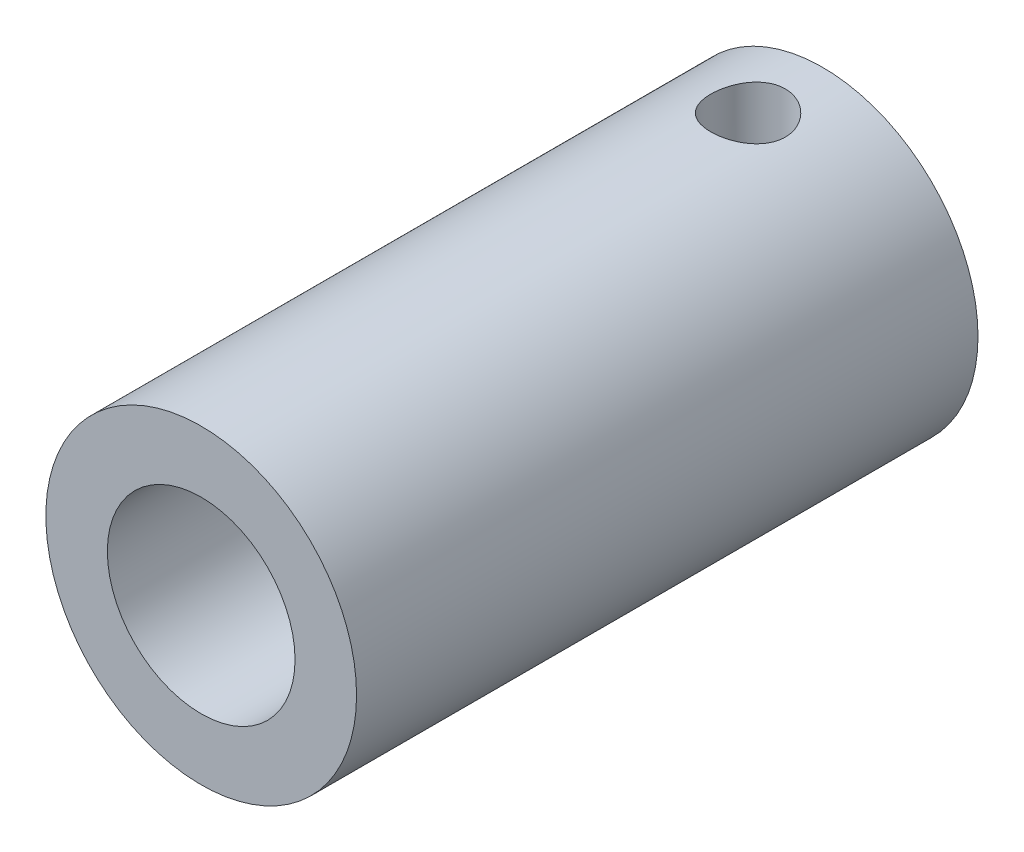
ISO-10303-21;
HEADER;
FILE_DESCRIPTION(('STEP AP214'),'2;1');
FILE_NAME('part.step','',(''),(''),'','','');
FILE_SCHEMA(('AUTOMOTIVE_DESIGN { 1 0 10303 214 1 1 1 1 }'));
ENDSEC;
DATA;
#1=APPLICATION_CONTEXT('core data for automotive mechanical design processes');
#2=APPLICATION_PROTOCOL_DEFINITION('international standard','automotive_design',2000,#1);
#3=PRODUCT_CONTEXT('',#1,'mechanical');
#4=PRODUCT('Part','Part','',(#3));
#5=PRODUCT_RELATED_PRODUCT_CATEGORY('part','',(#4));
#6=PRODUCT_DEFINITION_FORMATION('','',#4);
#7=PRODUCT_DEFINITION_CONTEXT('part definition',#1,'design');
#8=PRODUCT_DEFINITION('design','',#6,#7);
#9=PRODUCT_DEFINITION_SHAPE('','',#8);
#10=(LENGTH_UNIT() NAMED_UNIT(*) SI_UNIT(.MILLI.,.METRE.));
#11=(NAMED_UNIT(*) PLANE_ANGLE_UNIT() SI_UNIT($,.RADIAN.));
#12=(NAMED_UNIT(*) SI_UNIT($,.STERADIAN.) SOLID_ANGLE_UNIT());
#13=UNCERTAINTY_MEASURE_WITH_UNIT(LENGTH_MEASURE(1.E-05),#10,'distance_accuracy_value','');
#14=(GEOMETRIC_REPRESENTATION_CONTEXT(3) GLOBAL_UNCERTAINTY_ASSIGNED_CONTEXT((#13)) GLOBAL_UNIT_ASSIGNED_CONTEXT((#10,
#11,#12)) REPRESENTATION_CONTEXT('',''));
#15=CARTESIAN_POINT('',(0.,0.,0.));
#16=DIRECTION('',(0.,0.,1.));
#17=DIRECTION('',(1.,0.,0.));
#18=AXIS2_PLACEMENT_3D('',#15,#16,#17);
#19=CARTESIAN_POINT('',(0.,0.,100.));
#20=DIRECTION('',(0.,0.,-1.));
#21=DIRECTION('',(-1.,0.,0.));
#22=AXIS2_PLACEMENT_3D('',#19,#20,#21);
#23=CYLINDRICAL_SURFACE('',#22,25.);
#24=CARTESIAN_POINT('',(0.,0.,100.));
#25=DIRECTION('',(0.,0.,1.));
#26=DIRECTION('',(1.,0.,0.));
#27=AXIS2_PLACEMENT_3D('',#24,#25,#26);
#28=CIRCLE('',#27,25.);
#29=CARTESIAN_POINT('',(25.,0.,100.));
#30=VERTEX_POINT('',#29);
#31=EDGE_CURVE('E10',#30,#30,#28,.T.);
#32=ORIENTED_EDGE('',*,*,#31,.F.);
#33=EDGE_LOOP('',(#32));
#34=FACE_BOUND('',#33,.T.);
#35=CARTESIAN_POINT('',(0.,0.,0.));
#36=DIRECTION('',(0.,0.,1.));
#37=DIRECTION('',(1.,0.,0.));
#38=AXIS2_PLACEMENT_3D('',#35,#36,#37);
#39=CIRCLE('',#38,25.);
#40=CARTESIAN_POINT('',(25.,0.,0.));
#41=VERTEX_POINT('',#40);
#42=EDGE_CURVE('E48',#41,#41,#39,.T.);
#43=ORIENTED_EDGE('',*,*,#42,.T.);
#44=EDGE_LOOP('',(#43));
#45=FACE_BOUND('',#44,.T.);
#46=CARTESIAN_POINT('',(0.,-25.,6.));
#47=CARTESIAN_POINT('',(0.166017736340745,-25.0000026804997,5.99999543459786));
#48=CARTESIAN_POINT('',(0.331984064130571,-24.9983437383731,6.00689166849008));
#49=CARTESIAN_POINT('',(0.662757375273785,-24.9917601768854,6.03440900994736));
#50=CARTESIAN_POINT('',(0.827564209779564,-24.9868351457074,6.0550318482831));
#51=CARTESIAN_POINT('',(1.15483168687375,-24.9738504635424,6.10984641516744));
#52=CARTESIAN_POINT('',(1.31729147606247,-24.9657897007271,6.14404295659704));
#53=CARTESIAN_POINT('',(1.63872050759381,-24.9467537443302,6.22573807922991));
#54=CARTESIAN_POINT('',(1.79768844089951,-24.9357774773038,6.27324156020082));
#55=CARTESIAN_POINT('',(2.11072366381165,-24.9112316091515,6.38108459996277));
#56=CARTESIAN_POINT('',(2.26479812859838,-24.897666030887,6.44140426323733));
#57=CARTESIAN_POINT('',(2.56731972417304,-24.8682925860487,6.57448734959947));
#58=CARTESIAN_POINT('',(2.71576475309531,-24.8524838922068,6.64725536572495));
#59=CARTESIAN_POINT('',(3.00593509691774,-24.8190587739081,6.80465709055168));
#60=CARTESIAN_POINT('',(3.14766294672407,-24.8014430394569,6.88928627463913));
#61=CARTESIAN_POINT('',(3.42359889441685,-24.7648612187919,7.06987123980904));
#62=CARTESIAN_POINT('',(3.55780414185136,-24.7458946268123,7.16583127214067));
#63=CARTESIAN_POINT('',(3.81996752921303,-24.7067947855154,7.37010549956317));
#64=CARTESIAN_POINT('',(3.94778319107671,-24.6866473068088,7.47859986231368));
#65=CARTESIAN_POINT('',(4.19391043753479,-24.6460277155742,7.7059123541216));
#66=CARTESIAN_POINT('',(4.31221847908384,-24.6255554853983,7.82473429776544));
#67=CARTESIAN_POINT('',(4.53846894982133,-24.5848634527513,8.07185086415167));
#68=CARTESIAN_POINT('',(4.64641408237687,-24.5646435856504,8.20014300087693));
#69=CARTESIAN_POINT('',(4.85128465634762,-24.5250062264423,8.46543686711246));
#70=CARTESIAN_POINT('',(4.94820601608992,-24.5055890332168,8.60244179354435));
#71=CARTESIAN_POINT('',(5.1315149308875,-24.4678652790419,8.88608905875488));
#72=CARTESIAN_POINT('',(5.21774615640803,-24.4495768107614,9.03283492144758));
#73=CARTESIAN_POINT('',(5.37754406139993,-24.4149279468241,9.33335418271472));
#74=CARTESIAN_POINT('',(5.45110595933349,-24.3985682798489,9.48713020695951));
#75=CARTESIAN_POINT('',(5.58492026214268,-24.3682865029779,9.8005322339703));
#76=CARTESIAN_POINT('',(5.64517912327471,-24.354363211339,9.96015535496072));
#77=CARTESIAN_POINT('',(5.75195806967358,-24.3293636773731,10.2841471254746));
#78=CARTESIAN_POINT('',(5.79847322039682,-24.318288457803,10.4485174562414));
#79=CARTESIAN_POINT('',(5.91523377010968,-24.2902598679583,10.9408008041614));
#80=CARTESIAN_POINT('',(5.96534620186162,-24.2778811042379,11.2741252508861));
#81=CARTESIAN_POINT('',(5.99819895021148,-24.2697663322526,11.7764756017562));
#82=CARTESIAN_POINT('',(6.00209048242323,-24.2688053008257,11.944385487369));
#83=CARTESIAN_POINT('',(5.99581246294926,-24.2703574949624,12.2799466612594));
#84=CARTESIAN_POINT('',(5.98564275494965,-24.2728707591485,12.4475979466414));
#85=CARTESIAN_POINT('',(5.93483975630032,-24.285368999466,12.9407645620357));
#86=CARTESIAN_POINT('',(5.87440247397773,-24.3001939850224,13.2643389073699));
#87=CARTESIAN_POINT('',(5.70184242669472,-24.3412549446464,13.8964448597611));
#88=CARTESIAN_POINT('',(5.58971623816142,-24.3674916745551,14.2049754689114));
#89=CARTESIAN_POINT('',(5.3158825349441,-24.4286958367201,14.8018123116943));
#90=CARTESIAN_POINT('',(5.15371899452584,-24.4637429965247,15.0899012463867));
#91=CARTESIAN_POINT('',(4.78473374953622,-24.5385748778448,15.6352126614859));
#92=CARTESIAN_POINT('',(4.57790479882186,-24.5783603675971,15.8924301230166));
#93=CARTESIAN_POINT('',(4.11902988641842,-24.6594640880418,16.3757861221912));
#94=CARTESIAN_POINT('',(3.86594129003371,-24.7007951674045,16.6009339253001));
#95=CARTESIAN_POINT('',(3.32511184695823,-24.7793903091839,17.0057697123241));
#96=CARTESIAN_POINT('',(3.03737009894219,-24.8166542657671,17.1854565134257));
#97=CARTESIAN_POINT('',(2.43405695507431,-24.8830789940348,17.4945943681691));
#98=CARTESIAN_POINT('',(2.11840557448716,-24.9122154123614,17.6238948942683));
#99=CARTESIAN_POINT('',(1.46899521159138,-24.9589240940734,17.8273301763013));
#100=CARTESIAN_POINT('',(1.13523942521409,-24.9764983913503,17.9014746350329));
#101=CARTESIAN_POINT('',(0.467574800827578,-24.9978055089126,17.9910041295196));
#102=CARTESIAN_POINT('',(0.1338569665753,-25.0018564268946,18.0077398031267));
#103=CARTESIAN_POINT('',(-0.531608768658084,-24.9965614831509,17.9856664480962));
#104=CARTESIAN_POINT('',(-0.863356829944317,-24.9872167270307,17.946862003436));
#105=CARTESIAN_POINT('',(-1.51084514007902,-24.9563832816127,17.8159261145763));
#106=CARTESIAN_POINT('',(-1.8267410839496,-24.9350603275565,17.7245220476407));
#107=CARTESIAN_POINT('',(-2.4387066749497,-24.8826669936479,17.4918033497955));
#108=CARTESIAN_POINT('',(-2.73477441187555,-24.8515956762951,17.3504839183594));
#109=CARTESIAN_POINT('',(-3.30412273668564,-24.7823820658762,17.0192678250477));
#110=CARTESIAN_POINT('',(-3.57694246966835,-24.7441307708391,16.828602373031));
#111=CARTESIAN_POINT('',(-4.08719914724014,-24.6649871461435,16.4050823344903));
#112=CARTESIAN_POINT('',(-4.32463047973872,-24.6240943990595,16.1722210692648));
#113=CARTESIAN_POINT('',(-4.76284500809665,-24.5431489449983,15.6647328758583));
#114=CARTESIAN_POINT('',(-4.96268414096836,-24.5031358001301,15.3892845820887));
#115=CARTESIAN_POINT('',(-5.31333575577366,-24.4295058119813,14.8077643204089));
#116=CARTESIAN_POINT('',(-5.46415043292341,-24.395888682328,14.5016937245063));
#117=CARTESIAN_POINT('',(-5.64963439053451,-24.353347630646,14.0274063160141));
#118=CARTESIAN_POINT('',(-5.70458710242878,-24.3405033891164,13.8671930433855));
#119=CARTESIAN_POINT('',(-5.80079732294279,-24.3177552029261,13.542517979968));
#120=CARTESIAN_POINT('',(-5.84205998439171,-24.3078501521252,13.3780578128567));
#121=CARTESIAN_POINT('',(-5.91053741786634,-24.2912903166139,13.0460820967708));
#122=CARTESIAN_POINT('',(-5.93775173433045,-24.2846356373073,12.8785664488948));
#123=CARTESIAN_POINT('',(-5.97789965204539,-24.2747841701866,12.5417335331449));
#124=CARTESIAN_POINT('',(-5.99083389159895,-24.2715872278157,12.3724163461392));
#125=CARTESIAN_POINT('',(-6.00215499594078,-24.2687899616173,12.0377512694882));
#126=CARTESIAN_POINT('',(-6.00091722515411,-24.2690968340135,11.8724167155264));
#127=CARTESIAN_POINT('',(-5.98480872784869,-24.2730742483489,11.5424564780652));
#128=CARTESIAN_POINT('',(-5.969938298505,-24.2767447169658,11.3778307791921));
#129=CARTESIAN_POINT('',(-5.92668661056588,-24.2873399112073,11.0504453984338));
#130=CARTESIAN_POINT('',(-5.89830323162515,-24.294265147542,10.8876860135017));
#131=CARTESIAN_POINT('',(-5.82827196779404,-24.3111608262961,10.5652697985185));
#132=CARTESIAN_POINT('',(-5.78662876790753,-24.3211301931022,10.4056118937499));
#133=CARTESIAN_POINT('',(-5.69063662986335,-24.3437686465433,10.0911924810288));
#134=CARTESIAN_POINT('',(-5.63634876916799,-24.3564247302984,9.93641137281742));
#135=CARTESIAN_POINT('',(-5.51539707483437,-24.3840980883562,9.63204661186079));
#136=CARTESIAN_POINT('',(-5.44873755154826,-24.3991145400161,9.48246117040063));
#137=CARTESIAN_POINT('',(-5.30348427217981,-24.4310987091682,9.18933783308438));
#138=CARTESIAN_POINT('',(-5.22488523075194,-24.4480672900111,9.0458026516644));
#139=CARTESIAN_POINT('',(-5.05635243091258,-24.4834782828489,8.76580885483112));
#140=CARTESIAN_POINT('',(-4.96642242689347,-24.5019202059306,8.62934791648547));
#141=CARTESIAN_POINT('',(-4.77346921711415,-24.5402505889388,8.36104961670773));
#142=CARTESIAN_POINT('',(-4.67017903544834,-24.5601634300573,8.22940766887024));
#143=CARTESIAN_POINT('',(-4.45304880482868,-24.600458146359,7.97529158151));
#144=CARTESIAN_POINT('',(-4.33921237965749,-24.6208398586377,7.85281431887715));
#145=CARTESIAN_POINT('',(-4.10164015488732,-24.661530300392,7.61770688701807));
#146=CARTESIAN_POINT('',(-3.97789855094998,-24.6818389796797,7.50508257362257));
#147=CARTESIAN_POINT('',(-3.7214296777047,-24.7218081005976,7.29055189524238));
#148=CARTESIAN_POINT('',(-3.58870570477298,-24.7414687761375,7.18864163306687));
#149=CARTESIAN_POINT('',(-3.31280088827595,-24.7799327781137,6.99457607750455));
#150=CARTESIAN_POINT('',(-3.16948213881107,-24.7987162302532,6.90261275163753));
#151=CARTESIAN_POINT('',(-2.8754381763477,-24.8345280560803,6.7311469277116));
#152=CARTESIAN_POINT('',(-2.72471571591034,-24.8515570748485,6.6516398440273));
#153=CARTESIAN_POINT('',(-2.41692354679156,-24.883375777664,6.50568771285247));
#154=CARTESIAN_POINT('',(-2.25985686316147,-24.8981665133663,6.4392365266561));
#155=CARTESIAN_POINT('',(-1.94048744711081,-24.9250921884147,6.31989572796089));
#156=CARTESIAN_POINT('',(-1.77818555787967,-24.9372275530119,6.26700394372366));
#157=CARTESIAN_POINT('',(-1.35190448336008,-24.9647957983314,6.14797482654591));
#158=CARTESIAN_POINT('',(-1.08469226075993,-24.9779181465939,6.09257585150921));
#159=CARTESIAN_POINT('',(-0.544940331071898,-24.9955177731159,6.01859335579406));
#160=CARTESIAN_POINT('',(-0.272400964328513,-24.9999956018512,6.00000749088605));
#161=CARTESIAN_POINT('',(0.,-25.,6.));
#162=B_SPLINE_CURVE_WITH_KNOTS('',3,(#46,#47,#48,#49,#50,#51,#52,#53,#54,#55,#56,#57,#58,#59,
#60,#61,#62,#63,#64,#65,#66,#67,#68,#69,#70,#71,#72,#73,#74,#75,#76,#77,#78,#79,#80,#81,#82,#83,
#84,#85,#86,#87,#88,#89,#90,#91,#92,#93,#94,#95,#96,#97,#98,#99,#100,#101,#102,#103,#104,#105,
#106,#107,#108,#109,#110,#111,#112,#113,#114,#115,#116,#117,#118,#119,#120,#121,#122,#123,#124,
#125,#126,#127,#128,#129,#130,#131,#132,#133,#134,#135,#136,#137,#138,#139,#140,#141,#142,#143,
#144,#145,#146,#147,#148,#149,#150,#151,#152,#153,#154,#155,#156,#157,#158,#159,#160,#161),
.UNSPECIFIED.,.T.,.F.,(4,2,2,2,2,2,2,2,2,2,2,2,2,2,2,2,2,2,2,2,2,2,2,2,2,2,2,2,2,2,2,2,2,2,2,2,
2,2,2,2,2,2,2,2,2,2,2,2,2,2,2,2,2,2,2,2,2,4),(0.,0.497813360100955,0.995689500769748,
1.49374233325073,1.99197879609469,2.4894473877073,2.98709992652941,3.48456314269129,
3.98221359994715,4.48820831908741,4.99439073274951,5.50044073797177,6.00667750796929,
6.51961190143619,7.03273945954076,7.5456174354008,8.05867933189507,9.06463756237654,
9.56800871792682,10.0713854693234,11.0548629550303,12.0384055899336,13.0311908061742,
14.0241372047509,15.0430966233895,16.0620825507942,17.0840897493149,18.1059171185591,
19.1035329919673,20.1010665323702,21.085126203147,22.069280539993,23.0698021185097,
24.0704821968969,25.0936623603892,26.1167967016263,26.6258643414059,27.1347401541084,
27.6436324676663,28.1525020334114,28.6479253897995,29.1433379468293,29.6388282657176,
30.1341437102249,30.6271145113295,31.1199138801487,31.6129320389054,32.105787268885,
32.6107272666004,33.1154944014541,33.6205595212516,34.1254402854413,34.6387770201077,
35.1519243293048,35.6648297831432,36.1776530362049,36.9945144051894,37.8113237554193),.UNSPECIFIED.);
#163=CARTESIAN_POINT('',(0.,-25.,6.));
#164=VERTEX_POINT('',#163);
#165=EDGE_CURVE('E79',#164,#164,#162,.T.);
#166=ORIENTED_EDGE('',*,*,#165,.F.);
#167=EDGE_LOOP('',(#166));
#168=FACE_BOUND('',#167,.T.);
#169=CARTESIAN_POINT('',(0.,25.,6.));
#170=CARTESIAN_POINT('',(-0.166017736340745,25.0000026804997,5.99999543459786));
#171=CARTESIAN_POINT('',(-0.331984064130571,24.9983437383731,6.00689166849008));
#172=CARTESIAN_POINT('',(-0.662757375273785,24.9917601768854,6.03440900994736));
#173=CARTESIAN_POINT('',(-0.827564209779564,24.9868351457074,6.0550318482831));
#174=CARTESIAN_POINT('',(-1.15483168687375,24.9738504635424,6.10984641516744));
#175=CARTESIAN_POINT('',(-1.31729147606247,24.9657897007271,6.14404295659704));
#176=CARTESIAN_POINT('',(-1.63872050759381,24.9467537443302,6.22573807922991));
#177=CARTESIAN_POINT('',(-1.79768844089951,24.9357774773038,6.27324156020082));
#178=CARTESIAN_POINT('',(-2.11072366381165,24.9112316091515,6.38108459996277));
#179=CARTESIAN_POINT('',(-2.26479812859838,24.897666030887,6.44140426323733));
#180=CARTESIAN_POINT('',(-2.56731972417304,24.8682925860487,6.57448734959947));
#181=CARTESIAN_POINT('',(-2.71576475309531,24.8524838922068,6.64725536572495));
#182=CARTESIAN_POINT('',(-3.00593509691774,24.8190587739081,6.80465709055168));
#183=CARTESIAN_POINT('',(-3.14766294672407,24.8014430394569,6.88928627463913));
#184=CARTESIAN_POINT('',(-3.42359889441685,24.7648612187919,7.06987123980904));
#185=CARTESIAN_POINT('',(-3.55780414185136,24.7458946268123,7.16583127214067));
#186=CARTESIAN_POINT('',(-3.81996752921303,24.7067947855154,7.37010549956317));
#187=CARTESIAN_POINT('',(-3.94778319107671,24.6866473068088,7.47859986231368));
#188=CARTESIAN_POINT('',(-4.19391043753479,24.6460277155742,7.7059123541216));
#189=CARTESIAN_POINT('',(-4.31221847908384,24.6255554853983,7.82473429776544));
#190=CARTESIAN_POINT('',(-4.53846894982133,24.5848634527513,8.07185086415167));
#191=CARTESIAN_POINT('',(-4.64641408237687,24.5646435856504,8.20014300087693));
#192=CARTESIAN_POINT('',(-4.85128465634762,24.5250062264423,8.46543686711246));
#193=CARTESIAN_POINT('',(-4.94820601608992,24.5055890332168,8.60244179354435));
#194=CARTESIAN_POINT('',(-5.1315149308875,24.4678652790419,8.88608905875488));
#195=CARTESIAN_POINT('',(-5.21774615640803,24.4495768107614,9.03283492144758));
#196=CARTESIAN_POINT('',(-5.37754406139993,24.4149279468241,9.33335418271472));
#197=CARTESIAN_POINT('',(-5.45110595933349,24.3985682798489,9.48713020695951));
#198=CARTESIAN_POINT('',(-5.58492026214268,24.3682865029779,9.8005322339703));
#199=CARTESIAN_POINT('',(-5.64517912327471,24.354363211339,9.96015535496072));
#200=CARTESIAN_POINT('',(-5.75195806967358,24.3293636773731,10.2841471254746));
#201=CARTESIAN_POINT('',(-5.79847322039682,24.318288457803,10.4485174562414));
#202=CARTESIAN_POINT('',(-5.91523377010968,24.2902598679583,10.9408008041614));
#203=CARTESIAN_POINT('',(-5.96534620186162,24.2778811042379,11.2741252508861));
#204=CARTESIAN_POINT('',(-5.99819895021148,24.2697663322526,11.7764756017562));
#205=CARTESIAN_POINT('',(-6.00209048242323,24.2688053008257,11.944385487369));
#206=CARTESIAN_POINT('',(-5.99581246294926,24.2703574949624,12.2799466612594));
#207=CARTESIAN_POINT('',(-5.98564275494965,24.2728707591485,12.4475979466414));
#208=CARTESIAN_POINT('',(-5.93483975630032,24.285368999466,12.9407645620357));
#209=CARTESIAN_POINT('',(-5.87440247397773,24.3001939850224,13.2643389073699));
#210=CARTESIAN_POINT('',(-5.70184242669472,24.3412549446464,13.8964448597611));
#211=CARTESIAN_POINT('',(-5.58971623816142,24.3674916745551,14.2049754689114));
#212=CARTESIAN_POINT('',(-5.3158825349441,24.4286958367201,14.8018123116943));
#213=CARTESIAN_POINT('',(-5.15371899452584,24.4637429965247,15.0899012463867));
#214=CARTESIAN_POINT('',(-4.78473374953622,24.5385748778448,15.6352126614859));
#215=CARTESIAN_POINT('',(-4.57790479882186,24.5783603675971,15.8924301230166));
#216=CARTESIAN_POINT('',(-4.11902988641842,24.6594640880418,16.3757861221912));
#217=CARTESIAN_POINT('',(-3.86594129003371,24.7007951674045,16.6009339253001));
#218=CARTESIAN_POINT('',(-3.32511184695823,24.7793903091839,17.0057697123241));
#219=CARTESIAN_POINT('',(-3.03737009894219,24.8166542657671,17.1854565134257));
#220=CARTESIAN_POINT('',(-2.43405695507431,24.8830789940348,17.4945943681691));
#221=CARTESIAN_POINT('',(-2.11840557448716,24.9122154123614,17.6238948942683));
#222=CARTESIAN_POINT('',(-1.46899521159138,24.9589240940734,17.8273301763013));
#223=CARTESIAN_POINT('',(-1.13523942521409,24.9764983913503,17.9014746350329));
#224=CARTESIAN_POINT('',(-0.467574800827578,24.9978055089126,17.9910041295196));
#225=CARTESIAN_POINT('',(-0.1338569665753,25.0018564268946,18.0077398031267));
#226=CARTESIAN_POINT('',(0.531608768658084,24.9965614831509,17.9856664480962));
#227=CARTESIAN_POINT('',(0.863356829944317,24.9872167270307,17.946862003436));
#228=CARTESIAN_POINT('',(1.51084514007902,24.9563832816127,17.8159261145763));
#229=CARTESIAN_POINT('',(1.8267410839496,24.9350603275565,17.7245220476407));
#230=CARTESIAN_POINT('',(2.4387066749497,24.8826669936479,17.4918033497955));
#231=CARTESIAN_POINT('',(2.73477441187555,24.8515956762951,17.3504839183594));
#232=CARTESIAN_POINT('',(3.30412273668564,24.7823820658762,17.0192678250477));
#233=CARTESIAN_POINT('',(3.57694246966835,24.7441307708391,16.828602373031));
#234=CARTESIAN_POINT('',(4.08719914724014,24.6649871461435,16.4050823344903));
#235=CARTESIAN_POINT('',(4.32463047973872,24.6240943990595,16.1722210692648));
#236=CARTESIAN_POINT('',(4.76284500809665,24.5431489449983,15.6647328758583));
#237=CARTESIAN_POINT('',(4.96268414096836,24.5031358001301,15.3892845820887));
#238=CARTESIAN_POINT('',(5.31333575577366,24.4295058119813,14.8077643204089));
#239=CARTESIAN_POINT('',(5.46415043292341,24.395888682328,14.5016937245063));
#240=CARTESIAN_POINT('',(5.64963439053451,24.353347630646,14.0274063160141));
#241=CARTESIAN_POINT('',(5.70458710242878,24.3405033891164,13.8671930433855));
#242=CARTESIAN_POINT('',(5.80079732294279,24.3177552029261,13.542517979968));
#243=CARTESIAN_POINT('',(5.84205998439171,24.3078501521252,13.3780578128567));
#244=CARTESIAN_POINT('',(5.91053741786634,24.2912903166139,13.0460820967708));
#245=CARTESIAN_POINT('',(5.93775173433045,24.2846356373073,12.8785664488948));
#246=CARTESIAN_POINT('',(5.97789965204539,24.2747841701866,12.5417335331449));
#247=CARTESIAN_POINT('',(5.99083389159895,24.2715872278157,12.3724163461392));
#248=CARTESIAN_POINT('',(6.00215499594078,24.2687899616173,12.0377512694882));
#249=CARTESIAN_POINT('',(6.00091722515411,24.2690968340135,11.8724167155264));
#250=CARTESIAN_POINT('',(5.98480872784869,24.2730742483489,11.5424564780652));
#251=CARTESIAN_POINT('',(5.969938298505,24.2767447169658,11.3778307791921));
#252=CARTESIAN_POINT('',(5.92668661056588,24.2873399112073,11.0504453984338));
#253=CARTESIAN_POINT('',(5.89830323162515,24.294265147542,10.8876860135017));
#254=CARTESIAN_POINT('',(5.82827196779404,24.3111608262961,10.5652697985185));
#255=CARTESIAN_POINT('',(5.78662876790753,24.3211301931022,10.4056118937499));
#256=CARTESIAN_POINT('',(5.69063662986335,24.3437686465433,10.0911924810288));
#257=CARTESIAN_POINT('',(5.63634876916799,24.3564247302984,9.93641137281742));
#258=CARTESIAN_POINT('',(5.51539707483437,24.3840980883562,9.63204661186079));
#259=CARTESIAN_POINT('',(5.44873755154826,24.3991145400161,9.48246117040063));
#260=CARTESIAN_POINT('',(5.30348427217981,24.4310987091682,9.18933783308438));
#261=CARTESIAN_POINT('',(5.22488523075194,24.4480672900111,9.0458026516644));
#262=CARTESIAN_POINT('',(5.05635243091258,24.4834782828489,8.76580885483112));
#263=CARTESIAN_POINT('',(4.96642242689347,24.5019202059306,8.62934791648547));
#264=CARTESIAN_POINT('',(4.77346921711415,24.5402505889388,8.36104961670773));
#265=CARTESIAN_POINT('',(4.67017903544834,24.5601634300573,8.22940766887024));
#266=CARTESIAN_POINT('',(4.45304880482868,24.600458146359,7.97529158151));
#267=CARTESIAN_POINT('',(4.33921237965749,24.6208398586377,7.85281431887715));
#268=CARTESIAN_POINT('',(4.10164015488732,24.661530300392,7.61770688701807));
#269=CARTESIAN_POINT('',(3.97789855094998,24.6818389796797,7.50508257362257));
#270=CARTESIAN_POINT('',(3.7214296777047,24.7218081005976,7.29055189524238));
#271=CARTESIAN_POINT('',(3.58870570477298,24.7414687761375,7.18864163306687));
#272=CARTESIAN_POINT('',(3.31280088827595,24.7799327781137,6.99457607750455));
#273=CARTESIAN_POINT('',(3.16948213881107,24.7987162302532,6.90261275163753));
#274=CARTESIAN_POINT('',(2.8754381763477,24.8345280560803,6.7311469277116));
#275=CARTESIAN_POINT('',(2.72471571591034,24.8515570748485,6.6516398440273));
#276=CARTESIAN_POINT('',(2.41692354679156,24.883375777664,6.50568771285247));
#277=CARTESIAN_POINT('',(2.25985686316147,24.8981665133663,6.4392365266561));
#278=CARTESIAN_POINT('',(1.94048744711081,24.9250921884147,6.31989572796089));
#279=CARTESIAN_POINT('',(1.77818555787967,24.9372275530119,6.26700394372366));
#280=CARTESIAN_POINT('',(1.35190448336008,24.9647957983314,6.14797482654591));
#281=CARTESIAN_POINT('',(1.08469226075993,24.9779181465939,6.09257585150921));
#282=CARTESIAN_POINT('',(0.544940331071898,24.9955177731159,6.01859335579406));
#283=CARTESIAN_POINT('',(0.272400964328513,24.9999956018512,6.00000749088605));
#284=CARTESIAN_POINT('',(0.,25.,6.));
#285=B_SPLINE_CURVE_WITH_KNOTS('',3,(#169,#170,#171,#172,#173,#174,#175,#176,#177,#178,#179,
#180,#181,#182,#183,#184,#185,#186,#187,#188,#189,#190,#191,#192,#193,#194,#195,#196,#197,#198,
#199,#200,#201,#202,#203,#204,#205,#206,#207,#208,#209,#210,#211,#212,#213,#214,#215,#216,#217,
#218,#219,#220,#221,#222,#223,#224,#225,#226,#227,#228,#229,#230,#231,#232,#233,#234,#235,#236,
#237,#238,#239,#240,#241,#242,#243,#244,#245,#246,#247,#248,#249,#250,#251,#252,#253,#254,#255,
#256,#257,#258,#259,#260,#261,#262,#263,#264,#265,#266,#267,#268,#269,#270,#271,#272,#273,#274,
#275,#276,#277,#278,#279,#280,#281,#282,#283,#284),.UNSPECIFIED.,.T.,.F.,(4,2,2,2,2,2,2,2,2,2,2,
2,2,2,2,2,2,2,2,2,2,2,2,2,2,2,2,2,2,2,2,2,2,2,2,2,2,2,2,2,2,2,2,2,2,2,2,2,2,2,2,2,2,2,2,2,2,4),
(0.,0.497813360100955,0.995689500769748,1.49374233325073,1.99197879609469,2.4894473877073,
2.98709992652941,3.48456314269129,3.98221359994715,4.48820831908741,4.99439073274951,
5.50044073797177,6.00667750796929,6.51961190143619,7.03273945954076,7.5456174354008,
8.05867933189507,9.06463756237654,9.56800871792682,10.0713854693234,11.0548629550303,
12.0384055899336,13.0311908061742,14.0241372047509,15.0430966233895,16.0620825507942,
17.0840897493149,18.1059171185591,19.1035329919673,20.1010665323702,21.085126203147,
22.069280539993,23.0698021185097,24.0704821968969,25.0936623603892,26.1167967016263,
26.6258643414059,27.1347401541084,27.6436324676663,28.1525020334114,28.6479253897995,
29.1433379468293,29.6388282657176,30.1341437102249,30.6271145113295,31.1199138801487,
31.6129320389054,32.105787268885,32.6107272666004,33.1154944014541,33.6205595212516,
34.1254402854413,34.6387770201077,35.1519243293048,35.6648297831432,36.1776530362049,
36.9945144051894,37.8113237554193),.UNSPECIFIED.);
#286=CARTESIAN_POINT('',(0.,25.,6.));
#287=VERTEX_POINT('',#286);
#288=EDGE_CURVE('E85',#287,#287,#285,.T.);
#289=ORIENTED_EDGE('',*,*,#288,.F.);
#290=EDGE_LOOP('',(#289));
#291=FACE_BOUND('',#290,.T.);
#292=ADVANCED_FACE('F34',(#34,#45,#168,#291),#23,.T.);
#293=CARTESIAN_POINT('',(0.,0.,100.));
#294=DIRECTION('',(0.,0.,-1.));
#295=DIRECTION('',(-1.,0.,0.));
#296=AXIS2_PLACEMENT_3D('',#293,#294,#295);
#297=CYLINDRICAL_SURFACE('',#296,15.1);
#298=CARTESIAN_POINT('',(0.,-15.1,6.));
#299=CARTESIAN_POINT('',(0.161399213214296,-15.0999993078409,6.00000089202033));
#300=CARTESIAN_POINT('',(0.32286188686091,-15.0974050556886,6.0065214348127));
#301=CARTESIAN_POINT('',(0.644646119891598,-15.087093089725,6.03254514483479));
#302=CARTESIAN_POINT('',(0.804966837391845,-15.0793719260488,6.05205705389307));
#303=CARTESIAN_POINT('',(1.12356156468611,-15.0589886522614,6.10392427394756));
#304=CARTESIAN_POINT('',(1.28183039279304,-15.0463158827934,6.13630729528882));
#305=CARTESIAN_POINT('',(1.59489206406138,-15.0163597784813,6.21360824520003));
#306=CARTESIAN_POINT('',(1.74968345883084,-14.9990745597313,6.25853129595818));
#307=CARTESIAN_POINT('',(2.05412166424451,-14.9604158714499,6.36029710626553));
#308=CARTESIAN_POINT('',(2.2037853558336,-14.9390577282773,6.41709525484731));
#309=CARTESIAN_POINT('',(2.49768269498906,-14.8927407118988,6.5422436157572));
#310=CARTESIAN_POINT('',(2.6419142899576,-14.8677804944724,6.61059814232995));
#311=CARTESIAN_POINT('',(2.92394710504961,-14.8148943675252,6.75825954095863));
#312=CARTESIAN_POINT('',(3.06175323908825,-14.7869707796387,6.83755785359436));
#313=CARTESIAN_POINT('',(3.3303202064926,-14.7288113901302,7.00658683595005));
#314=CARTESIAN_POINT('',(3.46107846566072,-14.6985747533048,7.09632128012636));
#315=CARTESIAN_POINT('',(3.8523943164916,-14.6028407302048,7.38830040092092));
#316=CARTESIAN_POINT('',(4.10017202701837,-14.5346177344089,7.6071517139732));
#317=CARTESIAN_POINT('',(4.55660087806451,-14.3980676416292,8.08259661048212));
#318=CARTESIAN_POINT('',(4.76523309630809,-14.329740510313,8.33920834030724));
#319=CARTESIAN_POINT('',(5.04902029645983,-14.2312343947062,8.75389782879075));
#320=CARTESIAN_POINT('',(5.14034071353003,-14.1984188873949,8.90051537652832));
#321=CARTESIAN_POINT('',(5.31022176168397,-14.135760895291,9.20154057673324));
#322=CARTESIAN_POINT('',(5.38878763500349,-14.1059171910197,9.35594499435027));
#323=CARTESIAN_POINT('',(5.53249660016585,-14.0501754130546,9.6715756786304));
#324=CARTESIAN_POINT('',(5.59763873374796,-14.0242776210762,9.83280243131991));
#325=CARTESIAN_POINT('',(5.71382931652601,-13.9773418062334,10.1608662589519));
#326=CARTESIAN_POINT('',(5.76488479709281,-13.9563013596784,10.3277004880916));
#327=CARTESIAN_POINT('',(5.85042955805164,-13.92065106933,10.6582436887094));
#328=CARTESIAN_POINT('',(5.88555444420034,-13.9057969139004,10.8217618357144));
#329=CARTESIAN_POINT('',(5.94205436721637,-13.8817483143341,11.151499450657));
#330=CARTESIAN_POINT('',(5.96343559178958,-13.872551323295,11.3177176683539));
#331=CARTESIAN_POINT('',(5.99221539304036,-13.860144353981,11.6515498106276));
#332=CARTESIAN_POINT('',(5.99961682643878,-13.8569331525328,11.8191634430232));
#333=CARTESIAN_POINT('',(6.00035410501865,-13.8566140338309,12.1544235965396));
#334=CARTESIAN_POINT('',(5.99369059365424,-13.859505837372,12.3220701158049));
#335=CARTESIAN_POINT('',(5.96732376530154,-13.8708770961518,12.6445050107534));
#336=CARTESIAN_POINT('',(5.94854909759633,-13.8789584459306,12.7993845044143));
#337=CARTESIAN_POINT('',(5.89906447991948,-13.9000633605307,13.106934597902));
#338=CARTESIAN_POINT('',(5.86835059785797,-13.9130885535361,13.2596044528014));
#339=CARTESIAN_POINT('',(5.79529628493101,-13.9436761795644,13.5616260223541));
#340=CARTESIAN_POINT('',(5.75295867527575,-13.961237511554,13.7109785326689));
#341=CARTESIAN_POINT('',(5.65701644985048,-14.0003873991309,14.0055343018177));
#342=CARTESIAN_POINT('',(5.60340750620302,-14.0219775012943,14.1507359424353));
#343=CARTESIAN_POINT('',(5.48419552531756,-14.069036373273,14.4389338113828));
#344=CARTESIAN_POINT('',(5.41837544953987,-14.0945736518226,14.5818289858059));
#345=CARTESIAN_POINT('',(5.27595470426936,-14.1485016510252,14.8616352205201));
#346=CARTESIAN_POINT('',(5.19935038277642,-14.1768933373659,14.9985442329751));
#347=CARTESIAN_POINT('',(5.03588269300835,-14.2357799596848,15.2656399824605));
#348=CARTESIAN_POINT('',(4.94901797370305,-14.2662751724227,15.3958258309723));
#349=CARTESIAN_POINT('',(4.76555977864174,-14.3286016256131,15.6488160402599));
#350=CARTESIAN_POINT('',(4.66896580756382,-14.3604329340389,15.7716200247119));
#351=CARTESIAN_POINT('',(4.45883991055055,-14.4271204189244,16.0183289323723));
#352=CARTESIAN_POINT('',(4.34457766374103,-14.4620218327043,16.14160054582));
#353=CARTESIAN_POINT('',(4.10611221722273,-14.5315264244353,16.3781318758834));
#354=CARTESIAN_POINT('',(3.98191196871413,-14.5661296875693,16.4913945438961));
#355=CARTESIAN_POINT('',(3.72417540601566,-14.6341480059359,16.7073128316312));
#356=CARTESIAN_POINT('',(3.59063380072971,-14.6675623713266,16.8099623569869));
#357=CARTESIAN_POINT('',(3.31510197546087,-14.7322813934813,17.0038449263488));
#358=CARTESIAN_POINT('',(3.17311516306795,-14.7635868904325,17.0950825295022));
#359=CARTESIAN_POINT('',(2.87860271038292,-14.8238550271479,17.2671914400467));
#360=CARTESIAN_POINT('',(2.72592419676151,-14.852759100667,17.3478220980126));
#361=CARTESIAN_POINT('',(2.41367821745108,-14.9066845606639,17.4958159921438));
#362=CARTESIAN_POINT('',(2.25411355057138,-14.9317075059403,17.5631845577773));
#363=CARTESIAN_POINT('',(1.92920187561118,-14.9771519188818,17.6840316334792));
#364=CARTESIAN_POINT('',(1.76385599174579,-14.9975742754912,17.7375128272271));
#365=CARTESIAN_POINT('',(1.42862474102394,-15.0332110417833,17.8300308520361));
#366=CARTESIAN_POINT('',(1.25873968462249,-15.0484258066594,17.869068668249));
#367=CARTESIAN_POINT('',(0.925866461387092,-15.0724572587797,17.930405890867));
#368=CARTESIAN_POINT('',(0.763057157712801,-15.0815964996098,17.9535517794077));
#369=CARTESIAN_POINT('',(0.43588141583832,-15.0945952133527,17.9864040956031));
#370=CARTESIAN_POINT('',(0.271515053443653,-15.0984549419824,17.9961111741759));
#371=CARTESIAN_POINT('',(-0.0574608940861796,-15.1007864527567,18.0019795413367));
#372=CARTESIAN_POINT('',(-0.222070418582154,-15.0992594059585,17.9981437740694));
#373=CARTESIAN_POINT('',(-0.550279626361266,-15.0908627436478,17.9769752402924));
#374=CARTESIAN_POINT('',(-0.71387932848978,-15.0839932281426,17.9596427264323));
#375=CARTESIAN_POINT('',(-1.0315781911631,-15.0655246741696,17.9127382910424));
#376=CARTESIAN_POINT('',(-1.18577631247135,-15.0541495390938,17.8837449233452));
#377=CARTESIAN_POINT('',(-1.49110985763144,-15.0269787714453,17.8138736562993));
#378=CARTESIAN_POINT('',(-1.64224426123411,-15.0111816914352,17.772991865337));
#379=CARTESIAN_POINT('',(-1.94038242036561,-14.9755618141627,17.6797277270955));
#380=CARTESIAN_POINT('',(-2.0873873071757,-14.9557401319282,17.627348564872));
#381=CARTESIAN_POINT('',(-2.37647769596917,-14.912535835049,17.5114982892049));
#382=CARTESIAN_POINT('',(-2.51856130226245,-14.8891518665206,17.4480229571883));
#383=CARTESIAN_POINT('',(-2.80114408530984,-14.838625594151,17.3084056530434));
#384=CARTESIAN_POINT('',(-2.94146677802343,-14.8113913357949,17.2319398688983));
#385=CARTESIAN_POINT('',(-3.21524057724574,-14.7543820271159,17.0683006402388));
#386=CARTESIAN_POINT('',(-3.34868930603757,-14.7246061069655,16.9811235254879));
#387=CARTESIAN_POINT('',(-3.60798036185245,-14.6632272111763,16.7966444781722));
#388=CARTESIAN_POINT('',(-3.73382141566762,-14.6316239314355,16.6993408582274));
#389=CARTESIAN_POINT('',(-3.97723086442244,-14.5673430491757,16.4952049562184));
#390=CARTESIAN_POINT('',(-4.09479890497461,-14.5346654007222,16.3883722664056));
#391=CARTESIAN_POINT('',(-4.32846292204817,-14.4668642067717,16.1584849166955));
#392=CARTESIAN_POINT('',(-4.44395963757291,-14.4317204813206,16.0348262630321));
#393=CARTESIAN_POINT('',(-4.66414520478536,-14.3620709706664,15.7781389988031));
#394=CARTESIAN_POINT('',(-4.76883742303539,-14.3275649895169,15.6451133287629));
#395=CARTESIAN_POINT('',(-4.96683875265877,-14.2601353278108,15.3703417106652));
#396=CARTESIAN_POINT('',(-5.06014142117739,-14.2272125491651,15.228590894525));
#397=CARTESIAN_POINT('',(-5.23458974724153,-14.163957031714,14.9373242991877));
#398=CARTESIAN_POINT('',(-5.31574051563149,-14.1336232063685,14.7878118202219));
#399=CARTESIAN_POINT('',(-5.46599273739812,-14.0762018327082,14.4804165968856));
#400=CARTESIAN_POINT('',(-5.53497165804353,-14.0491480699131,14.3224675278143));
#401=CARTESIAN_POINT('',(-5.65924845773947,-13.9995495112919,14.000660507223));
#402=CARTESIAN_POINT('',(-5.71455217906544,-13.9770027907729,13.8368051133835));
#403=CARTESIAN_POINT('',(-5.81091570723525,-13.9372156292124,13.5043907814542));
#404=CARTESIAN_POINT('',(-5.85198101280737,-13.9199731400226,13.3358336863453));
#405=CARTESIAN_POINT('',(-5.91941474829843,-13.8914317479036,12.9953123486647));
#406=CARTESIAN_POINT('',(-5.94578438554544,-13.8801323567213,12.8233483871878));
#407=CARTESIAN_POINT('',(-5.98215673418333,-13.8644927708687,12.4898055737177));
#408=CARTESIAN_POINT('',(-5.99319104780436,-13.8597143814871,12.3283590141666));
#409=CARTESIAN_POINT('',(-6.00217671066412,-13.8558255258686,12.0050361558362));
#410=CARTESIAN_POINT('',(-6.00012860310652,-13.8567148243001,11.8431598751786));
#411=CARTESIAN_POINT('',(-5.98297437069036,-13.8641300964409,11.5202530378313));
#412=CARTESIAN_POINT('',(-5.96786979392134,-13.8706554018957,11.3592223831539));
#413=CARTESIAN_POINT('',(-5.92477451847952,-13.8891178547863,11.0392123641238));
#414=CARTESIAN_POINT('',(-5.89678387290508,-13.9010549799222,10.8802329913212));
#415=CARTESIAN_POINT('',(-5.82954736685516,-13.9293808444925,10.5715922825705));
#416=CARTESIAN_POINT('',(-5.79078012842047,-13.9455789781945,10.421808691608));
#417=CARTESIAN_POINT('',(-5.70195934399563,-13.9821301906886,10.1260992725624));
#418=CARTESIAN_POINT('',(-5.65190211642027,-14.0024846246154,9.98017472026543));
#419=CARTESIAN_POINT('',(-5.54092666513052,-14.0467681978363,9.69309627623309));
#420=CARTESIAN_POINT('',(-5.48000988096149,-14.0706968632613,9.55194175512786));
#421=CARTESIAN_POINT('',(-5.34776699032021,-14.1214873023148,9.27512406342065));
#422=CARTESIAN_POINT('',(-5.27643710429119,-14.1483501400401,9.13946290963579));
#423=CARTESIAN_POINT('',(-5.03891862513389,-14.2354767405034,8.72683873011199));
#424=CARTESIAN_POINT('',(-4.85542115978214,-14.2996770360826,8.46042723846695));
#425=CARTESIAN_POINT('',(-4.44855762383451,-14.4314207275473,7.96091992430786));
#426=CARTESIAN_POINT('',(-4.22517982748351,-14.4989651024382,7.72783393667212));
#427=CARTESIAN_POINT('',(-3.85638122380132,-14.5998642323153,7.40024634507291));
#428=CARTESIAN_POINT('',(-3.72335090029554,-14.6344371225686,7.29190789136219));
#429=CARTESIAN_POINT('',(-3.44821210615748,-14.7016956162349,7.08683002586936));
#430=CARTESIAN_POINT('',(-3.30610700018523,-14.7343819106819,6.99008635292198));
#431=CARTESIAN_POINT('',(-3.01353507144477,-14.7969933390768,6.80882918873841));
#432=CARTESIAN_POINT('',(-2.86306050254373,-14.8269158445782,6.72432729727108));
#433=CARTESIAN_POINT('',(-2.55490511734014,-14.8831102165895,6.56840187615144));
#434=CARTESIAN_POINT('',(-2.39722763159386,-14.9093837480907,6.49697237693572));
#435=CARTESIAN_POINT('',(-2.07866313052544,-14.9570926232564,6.36900714479249));
#436=CARTESIAN_POINT('',(-1.91788856213167,-14.9786080979734,6.31222153844803));
#437=CARTESIAN_POINT('',(-1.59162518270989,-15.0167801023646,6.21244346484212));
#438=CARTESIAN_POINT('',(-1.42613862234769,-15.0334389104499,6.16944452888361));
#439=CARTESIAN_POINT('',(-1.09209677313876,-15.0613860725685,6.09775995351357));
#440=CARTESIAN_POINT('',(-0.923550333280841,-15.0726879421821,6.06903828346392));
#441=CARTESIAN_POINT('',(-0.584425086248174,-15.0896397230374,6.02608833723267));
#442=CARTESIAN_POINT('',(-0.413847925408032,-15.0952939340297,6.01184903499138));
#443=CARTESIAN_POINT('',(-0.202526405899049,-15.0986962388004,6.00328194846119));
#444=CARTESIAN_POINT('',(-0.16203353396567,-15.0991849428164,6.00205148426907));
#445=CARTESIAN_POINT('',(-0.0810284410310358,-15.0998369101561,6.00041039842074));
#446=CARTESIAN_POINT('',(-0.0405162200460793,-15.1000001737534,5.99999977607517));
#447=CARTESIAN_POINT('',(0.,-15.1,6.));
#448=B_SPLINE_CURVE_WITH_KNOTS('',3,(#298,#299,#300,#301,#302,#303,#304,#305,#306,#307,#308,
#309,#310,#311,#312,#313,#314,#315,#316,#317,#318,#319,#320,#321,#322,#323,#324,#325,#326,#327,
#328,#329,#330,#331,#332,#333,#334,#335,#336,#337,#338,#339,#340,#341,#342,#343,#344,#345,#346,
#347,#348,#349,#350,#351,#352,#353,#354,#355,#356,#357,#358,#359,#360,#361,#362,#363,#364,#365,
#366,#367,#368,#369,#370,#371,#372,#373,#374,#375,#376,#377,#378,#379,#380,#381,#382,#383,#384,
#385,#386,#387,#388,#389,#390,#391,#392,#393,#394,#395,#396,#397,#398,#399,#400,#401,#402,#403,
#404,#405,#406,#407,#408,#409,#410,#411,#412,#413,#414,#415,#416,#417,#418,#419,#420,#421,#422,
#423,#424,#425,#426,#427,#428,#429,#430,#431,#432,#433,#434,#435,#436,#437,#438,#439,#440,#441,
#442,#443,#444,#445,#446,#447),.UNSPECIFIED.,.T.,.F.,(4,2,2,2,2,2,2,2,2,2,2,2,2,2,2,2,2,2,2,2,2,
2,2,2,2,2,2,2,2,2,2,2,2,2,2,2,2,2,2,2,2,2,2,2,2,2,2,2,2,2,2,2,2,2,2,2,2,2,2,2,2,2,2,2,2,2,2,2,2,
2,2,2,2,2,4),(0.,0.484155923956128,0.968637963824466,1.45416874921493,1.93989814884493,
2.42383458987317,2.90795209534539,3.39169308340985,3.87560957432422,4.88356861946054,
5.89201364691708,6.41891857643992,6.94560639184436,7.47233179212069,7.99879379912575,
8.50184959262118,9.00467874014229,9.50740512518576,10.0101085116058,10.4782270099194,
10.9464998103157,11.4146590559279,11.882998390981,12.3606380080175,12.8384397647954,
13.3163045060418,13.7941935879701,14.3086101533316,14.8228745199065,15.3374325704176,
15.851784390093,16.3763066853569,16.9006177653009,17.4248274486822,17.9490013702534,
18.4424731088934,18.9359209450466,19.4292615147986,19.9225928497886,20.3939860651719,
20.8655337627127,21.3369509943966,21.808547842145,22.2943427106798,22.7803045034386,
23.2663474020859,23.7524111084835,24.2702671509969,24.7879613449814,25.3059470449709,
25.8237142750094,26.3464284900214,26.8689190053956,27.3912075150242,27.9134531095187,
28.3985166229776,28.8835599959314,29.3685458657753,29.8535297372032,30.3197041280064,
30.7860307553182,31.2522956121677,31.7187301280071,32.7036310541481,33.6888220426691,
34.2133251582599,34.7376349202413,35.2624382901694,35.7870014051409,36.3019120760019,
36.8165807963495,37.3299440007234,37.8429160660123,37.9644543564116,38.0859925446156),.UNSPECIFIED.);
#449=CARTESIAN_POINT('',(0.,-15.1,6.));
#450=VERTEX_POINT('',#449);
#451=EDGE_CURVE('E60',#450,#450,#448,.T.);
#452=ORIENTED_EDGE('',*,*,#451,.T.);
#453=EDGE_LOOP('',(#452));
#454=FACE_BOUND('',#453,.T.);
#455=CARTESIAN_POINT('',(0.,0.,100.));
#456=DIRECTION('',(0.,0.,1.));
#457=DIRECTION('',(1.,0.,0.));
#458=AXIS2_PLACEMENT_3D('',#455,#456,#457);
#459=CIRCLE('',#458,15.1);
#460=CARTESIAN_POINT('',(15.1,0.,100.));
#461=VERTEX_POINT('',#460);
#462=EDGE_CURVE('E55',#461,#461,#459,.T.);
#463=ORIENTED_EDGE('',*,*,#462,.T.);
#464=EDGE_LOOP('',(#463));
#465=FACE_BOUND('',#464,.T.);
#466=CARTESIAN_POINT('',(0.,0.,0.));
#467=DIRECTION('',(0.,0.,1.));
#468=DIRECTION('',(1.,0.,0.));
#469=AXIS2_PLACEMENT_3D('',#466,#467,#468);
#470=CIRCLE('',#469,15.1);
#471=CARTESIAN_POINT('',(15.1,0.,0.));
#472=VERTEX_POINT('',#471);
#473=EDGE_CURVE('E58',#472,#472,#470,.T.);
#474=ORIENTED_EDGE('',*,*,#473,.F.);
#475=EDGE_LOOP('',(#474));
#476=FACE_BOUND('',#475,.T.);
#477=CARTESIAN_POINT('',(0.,15.1,6.));
#478=CARTESIAN_POINT('',(-0.161399213214296,15.0999993078409,6.00000089202033));
#479=CARTESIAN_POINT('',(-0.32286188686091,15.0974050556886,6.0065214348127));
#480=CARTESIAN_POINT('',(-0.644646119891598,15.087093089725,6.03254514483479));
#481=CARTESIAN_POINT('',(-0.804966837391845,15.0793719260488,6.05205705389307));
#482=CARTESIAN_POINT('',(-1.12356156468611,15.0589886522614,6.10392427394756));
#483=CARTESIAN_POINT('',(-1.28183039279304,15.0463158827934,6.13630729528882));
#484=CARTESIAN_POINT('',(-1.59489206406138,15.0163597784813,6.21360824520003));
#485=CARTESIAN_POINT('',(-1.74968345883084,14.9990745597313,6.25853129595818));
#486=CARTESIAN_POINT('',(-2.05412166424451,14.9604158714499,6.36029710626553));
#487=CARTESIAN_POINT('',(-2.2037853558336,14.9390577282773,6.41709525484731));
#488=CARTESIAN_POINT('',(-2.49768269498906,14.8927407118988,6.5422436157572));
#489=CARTESIAN_POINT('',(-2.6419142899576,14.8677804944724,6.61059814232995));
#490=CARTESIAN_POINT('',(-2.92394710504961,14.8148943675252,6.75825954095863));
#491=CARTESIAN_POINT('',(-3.06175323908825,14.7869707796387,6.83755785359436));
#492=CARTESIAN_POINT('',(-3.3303202064926,14.7288113901302,7.00658683595005));
#493=CARTESIAN_POINT('',(-3.46107846566072,14.6985747533048,7.09632128012636));
#494=CARTESIAN_POINT('',(-3.8523943164916,14.6028407302048,7.38830040092092));
#495=CARTESIAN_POINT('',(-4.10017202701837,14.5346177344089,7.6071517139732));
#496=CARTESIAN_POINT('',(-4.55660087806451,14.3980676416292,8.08259661048212));
#497=CARTESIAN_POINT('',(-4.76523309630809,14.329740510313,8.33920834030724));
#498=CARTESIAN_POINT('',(-5.04902029645983,14.2312343947062,8.75389782879075));
#499=CARTESIAN_POINT('',(-5.14034071353003,14.1984188873949,8.90051537652832));
#500=CARTESIAN_POINT('',(-5.31022176168397,14.135760895291,9.20154057673324));
#501=CARTESIAN_POINT('',(-5.38878763500349,14.1059171910197,9.35594499435027));
#502=CARTESIAN_POINT('',(-5.53249660016585,14.0501754130546,9.6715756786304));
#503=CARTESIAN_POINT('',(-5.59763873374796,14.0242776210762,9.83280243131991));
#504=CARTESIAN_POINT('',(-5.71382931652601,13.9773418062334,10.1608662589519));
#505=CARTESIAN_POINT('',(-5.76488479709281,13.9563013596784,10.3277004880916));
#506=CARTESIAN_POINT('',(-5.85042955805164,13.92065106933,10.6582436887094));
#507=CARTESIAN_POINT('',(-5.88555444420034,13.9057969139004,10.8217618357144));
#508=CARTESIAN_POINT('',(-5.94205436721637,13.8817483143341,11.151499450657));
#509=CARTESIAN_POINT('',(-5.96343559178958,13.872551323295,11.3177176683539));
#510=CARTESIAN_POINT('',(-5.99221539304036,13.860144353981,11.6515498106276));
#511=CARTESIAN_POINT('',(-5.99961682643878,13.8569331525328,11.8191634430232));
#512=CARTESIAN_POINT('',(-6.00035410501865,13.8566140338309,12.1544235965396));
#513=CARTESIAN_POINT('',(-5.99369059365424,13.859505837372,12.3220701158049));
#514=CARTESIAN_POINT('',(-5.96732376530154,13.8708770961518,12.6445050107534));
#515=CARTESIAN_POINT('',(-5.94854909759633,13.8789584459306,12.7993845044143));
#516=CARTESIAN_POINT('',(-5.89906447991948,13.9000633605307,13.106934597902));
#517=CARTESIAN_POINT('',(-5.86835059785797,13.9130885535361,13.2596044528014));
#518=CARTESIAN_POINT('',(-5.79529628493101,13.9436761795644,13.5616260223541));
#519=CARTESIAN_POINT('',(-5.75295867527575,13.961237511554,13.7109785326689));
#520=CARTESIAN_POINT('',(-5.65701644985048,14.0003873991309,14.0055343018177));
#521=CARTESIAN_POINT('',(-5.60340750620302,14.0219775012943,14.1507359424353));
#522=CARTESIAN_POINT('',(-5.48419552531756,14.069036373273,14.4389338113828));
#523=CARTESIAN_POINT('',(-5.41837544953987,14.0945736518226,14.5818289858059));
#524=CARTESIAN_POINT('',(-5.27595470426936,14.1485016510252,14.8616352205201));
#525=CARTESIAN_POINT('',(-5.19935038277642,14.1768933373659,14.9985442329751));
#526=CARTESIAN_POINT('',(-5.03588269300835,14.2357799596848,15.2656399824605));
#527=CARTESIAN_POINT('',(-4.94901797370305,14.2662751724227,15.3958258309723));
#528=CARTESIAN_POINT('',(-4.76555977864174,14.3286016256131,15.6488160402599));
#529=CARTESIAN_POINT('',(-4.66896580756382,14.3604329340389,15.7716200247119));
#530=CARTESIAN_POINT('',(-4.45883991055055,14.4271204189244,16.0183289323723));
#531=CARTESIAN_POINT('',(-4.34457766374103,14.4620218327043,16.14160054582));
#532=CARTESIAN_POINT('',(-4.10611221722273,14.5315264244353,16.3781318758834));
#533=CARTESIAN_POINT('',(-3.98191196871413,14.5661296875693,16.4913945438961));
#534=CARTESIAN_POINT('',(-3.72417540601566,14.6341480059359,16.7073128316312));
#535=CARTESIAN_POINT('',(-3.59063380072971,14.6675623713266,16.8099623569869));
#536=CARTESIAN_POINT('',(-3.31510197546087,14.7322813934813,17.0038449263488));
#537=CARTESIAN_POINT('',(-3.17311516306795,14.7635868904325,17.0950825295022));
#538=CARTESIAN_POINT('',(-2.87860271038292,14.8238550271479,17.2671914400467));
#539=CARTESIAN_POINT('',(-2.72592419676151,14.852759100667,17.3478220980126));
#540=CARTESIAN_POINT('',(-2.41367821745108,14.9066845606639,17.4958159921438));
#541=CARTESIAN_POINT('',(-2.25411355057138,14.9317075059403,17.5631845577773));
#542=CARTESIAN_POINT('',(-1.92920187561118,14.9771519188818,17.6840316334792));
#543=CARTESIAN_POINT('',(-1.76385599174579,14.9975742754912,17.7375128272271));
#544=CARTESIAN_POINT('',(-1.42862474102394,15.0332110417833,17.8300308520361));
#545=CARTESIAN_POINT('',(-1.25873968462249,15.0484258066594,17.869068668249));
#546=CARTESIAN_POINT('',(-0.925866461387092,15.0724572587797,17.930405890867));
#547=CARTESIAN_POINT('',(-0.763057157712801,15.0815964996098,17.9535517794077));
#548=CARTESIAN_POINT('',(-0.43588141583832,15.0945952133527,17.9864040956031));
#549=CARTESIAN_POINT('',(-0.271515053443653,15.0984549419824,17.9961111741759));
#550=CARTESIAN_POINT('',(0.0574608940861796,15.1007864527567,18.0019795413367));
#551=CARTESIAN_POINT('',(0.222070418582154,15.0992594059585,17.9981437740694));
#552=CARTESIAN_POINT('',(0.550279626361266,15.0908627436478,17.9769752402924));
#553=CARTESIAN_POINT('',(0.71387932848978,15.0839932281426,17.9596427264323));
#554=CARTESIAN_POINT('',(1.0315781911631,15.0655246741696,17.9127382910424));
#555=CARTESIAN_POINT('',(1.18577631247135,15.0541495390938,17.8837449233452));
#556=CARTESIAN_POINT('',(1.49110985763144,15.0269787714453,17.8138736562993));
#557=CARTESIAN_POINT('',(1.64224426123411,15.0111816914352,17.772991865337));
#558=CARTESIAN_POINT('',(1.94038242036561,14.9755618141627,17.6797277270955));
#559=CARTESIAN_POINT('',(2.0873873071757,14.9557401319282,17.627348564872));
#560=CARTESIAN_POINT('',(2.37647769596917,14.912535835049,17.5114982892049));
#561=CARTESIAN_POINT('',(2.51856130226245,14.8891518665206,17.4480229571883));
#562=CARTESIAN_POINT('',(2.80114408530984,14.838625594151,17.3084056530434));
#563=CARTESIAN_POINT('',(2.94146677802343,14.8113913357949,17.2319398688983));
#564=CARTESIAN_POINT('',(3.21524057724574,14.7543820271159,17.0683006402388));
#565=CARTESIAN_POINT('',(3.34868930603757,14.7246061069655,16.9811235254879));
#566=CARTESIAN_POINT('',(3.60798036185245,14.6632272111763,16.7966444781722));
#567=CARTESIAN_POINT('',(3.73382141566762,14.6316239314355,16.6993408582274));
#568=CARTESIAN_POINT('',(3.97723086442244,14.5673430491757,16.4952049562184));
#569=CARTESIAN_POINT('',(4.09479890497461,14.5346654007222,16.3883722664056));
#570=CARTESIAN_POINT('',(4.32846292204817,14.4668642067717,16.1584849166955));
#571=CARTESIAN_POINT('',(4.44395963757291,14.4317204813206,16.0348262630321));
#572=CARTESIAN_POINT('',(4.66414520478536,14.3620709706664,15.7781389988031));
#573=CARTESIAN_POINT('',(4.76883742303539,14.3275649895169,15.6451133287629));
#574=CARTESIAN_POINT('',(4.96683875265877,14.2601353278108,15.3703417106652));
#575=CARTESIAN_POINT('',(5.06014142117739,14.2272125491651,15.228590894525));
#576=CARTESIAN_POINT('',(5.23458974724153,14.163957031714,14.9373242991877));
#577=CARTESIAN_POINT('',(5.31574051563149,14.1336232063685,14.7878118202219));
#578=CARTESIAN_POINT('',(5.46599273739812,14.0762018327082,14.4804165968856));
#579=CARTESIAN_POINT('',(5.53497165804353,14.0491480699131,14.3224675278143));
#580=CARTESIAN_POINT('',(5.65924845773947,13.9995495112919,14.000660507223));
#581=CARTESIAN_POINT('',(5.71455217906544,13.9770027907729,13.8368051133835));
#582=CARTESIAN_POINT('',(5.81091570723525,13.9372156292124,13.5043907814542));
#583=CARTESIAN_POINT('',(5.85198101280737,13.9199731400226,13.3358336863453));
#584=CARTESIAN_POINT('',(5.91941474829843,13.8914317479036,12.9953123486647));
#585=CARTESIAN_POINT('',(5.94578438554544,13.8801323567213,12.8233483871878));
#586=CARTESIAN_POINT('',(5.98215673418333,13.8644927708687,12.4898055737177));
#587=CARTESIAN_POINT('',(5.99319104780436,13.8597143814871,12.3283590141666));
#588=CARTESIAN_POINT('',(6.00217671066412,13.8558255258686,12.0050361558362));
#589=CARTESIAN_POINT('',(6.00012860310652,13.8567148243001,11.8431598751786));
#590=CARTESIAN_POINT('',(5.98297437069036,13.8641300964409,11.5202530378313));
#591=CARTESIAN_POINT('',(5.96786979392134,13.8706554018957,11.3592223831539));
#592=CARTESIAN_POINT('',(5.92477451847952,13.8891178547863,11.0392123641238));
#593=CARTESIAN_POINT('',(5.89678387290508,13.9010549799222,10.8802329913212));
#594=CARTESIAN_POINT('',(5.82954736685516,13.9293808444925,10.5715922825705));
#595=CARTESIAN_POINT('',(5.79078012842047,13.9455789781945,10.421808691608));
#596=CARTESIAN_POINT('',(5.70195934399563,13.9821301906886,10.1260992725624));
#597=CARTESIAN_POINT('',(5.65190211642027,14.0024846246154,9.98017472026543));
#598=CARTESIAN_POINT('',(5.54092666513052,14.0467681978363,9.69309627623309));
#599=CARTESIAN_POINT('',(5.48000988096149,14.0706968632613,9.55194175512786));
#600=CARTESIAN_POINT('',(5.34776699032021,14.1214873023148,9.27512406342065));
#601=CARTESIAN_POINT('',(5.27643710429119,14.1483501400401,9.13946290963579));
#602=CARTESIAN_POINT('',(5.03891862513389,14.2354767405034,8.72683873011199));
#603=CARTESIAN_POINT('',(4.85542115978214,14.2996770360826,8.46042723846695));
#604=CARTESIAN_POINT('',(4.44855762383451,14.4314207275473,7.96091992430786));
#605=CARTESIAN_POINT('',(4.22517982748351,14.4989651024382,7.72783393667212));
#606=CARTESIAN_POINT('',(3.85638122380132,14.5998642323153,7.40024634507291));
#607=CARTESIAN_POINT('',(3.72335090029554,14.6344371225686,7.29190789136219));
#608=CARTESIAN_POINT('',(3.44821210615748,14.7016956162349,7.08683002586936));
#609=CARTESIAN_POINT('',(3.30610700018523,14.7343819106819,6.99008635292198));
#610=CARTESIAN_POINT('',(3.01353507144477,14.7969933390768,6.80882918873841));
#611=CARTESIAN_POINT('',(2.86306050254373,14.8269158445782,6.72432729727108));
#612=CARTESIAN_POINT('',(2.55490511734014,14.8831102165895,6.56840187615144));
#613=CARTESIAN_POINT('',(2.39722763159386,14.9093837480907,6.49697237693572));
#614=CARTESIAN_POINT('',(2.07866313052544,14.9570926232564,6.36900714479249));
#615=CARTESIAN_POINT('',(1.91788856213167,14.9786080979734,6.31222153844803));
#616=CARTESIAN_POINT('',(1.59162518270989,15.0167801023646,6.21244346484212));
#617=CARTESIAN_POINT('',(1.42613862234769,15.0334389104499,6.16944452888361));
#618=CARTESIAN_POINT('',(1.09209677313876,15.0613860725685,6.09775995351357));
#619=CARTESIAN_POINT('',(0.923550333280841,15.0726879421821,6.06903828346392));
#620=CARTESIAN_POINT('',(0.584425086248174,15.0896397230374,6.02608833723267));
#621=CARTESIAN_POINT('',(0.413847925408032,15.0952939340297,6.01184903499138));
#622=CARTESIAN_POINT('',(0.202526405899049,15.0986962388004,6.00328194846119));
#623=CARTESIAN_POINT('',(0.16203353396567,15.0991849428164,6.00205148426907));
#624=CARTESIAN_POINT('',(0.0810284410310358,15.0998369101561,6.00041039842074));
#625=CARTESIAN_POINT('',(0.0405162200460793,15.1000001737534,5.99999977607517));
#626=CARTESIAN_POINT('',(0.,15.1,6.));
#627=B_SPLINE_CURVE_WITH_KNOTS('',3,(#477,#478,#479,#480,#481,#482,#483,#484,#485,#486,#487,
#488,#489,#490,#491,#492,#493,#494,#495,#496,#497,#498,#499,#500,#501,#502,#503,#504,#505,#506,
#507,#508,#509,#510,#511,#512,#513,#514,#515,#516,#517,#518,#519,#520,#521,#522,#523,#524,#525,
#526,#527,#528,#529,#530,#531,#532,#533,#534,#535,#536,#537,#538,#539,#540,#541,#542,#543,#544,
#545,#546,#547,#548,#549,#550,#551,#552,#553,#554,#555,#556,#557,#558,#559,#560,#561,#562,#563,
#564,#565,#566,#567,#568,#569,#570,#571,#572,#573,#574,#575,#576,#577,#578,#579,#580,#581,#582,
#583,#584,#585,#586,#587,#588,#589,#590,#591,#592,#593,#594,#595,#596,#597,#598,#599,#600,#601,
#602,#603,#604,#605,#606,#607,#608,#609,#610,#611,#612,#613,#614,#615,#616,#617,#618,#619,#620,
#621,#622,#623,#624,#625,#626),.UNSPECIFIED.,.T.,.F.,(4,2,2,2,2,2,2,2,2,2,2,2,2,2,2,2,2,2,2,2,2,
2,2,2,2,2,2,2,2,2,2,2,2,2,2,2,2,2,2,2,2,2,2,2,2,2,2,2,2,2,2,2,2,2,2,2,2,2,2,2,2,2,2,2,2,2,2,2,2,
2,2,2,2,2,4),(0.,0.484155923956128,0.968637963824466,1.45416874921493,1.93989814884493,
2.42383458987317,2.90795209534539,3.39169308340985,3.87560957432422,4.88356861946054,
5.89201364691708,6.41891857643992,6.94560639184436,7.47233179212069,7.99879379912575,
8.50184959262118,9.00467874014229,9.50740512518576,10.0101085116058,10.4782270099194,
10.9464998103157,11.4146590559279,11.882998390981,12.3606380080175,12.8384397647954,
13.3163045060418,13.7941935879701,14.3086101533316,14.8228745199065,15.3374325704176,
15.851784390093,16.3763066853569,16.9006177653009,17.4248274486822,17.9490013702534,
18.4424731088934,18.9359209450466,19.4292615147986,19.9225928497886,20.3939860651719,
20.8655337627127,21.3369509943966,21.808547842145,22.2943427106798,22.7803045034386,
23.2663474020859,23.7524111084835,24.2702671509969,24.7879613449814,25.3059470449709,
25.8237142750094,26.3464284900214,26.8689190053956,27.3912075150242,27.9134531095187,
28.3985166229776,28.8835599959314,29.3685458657753,29.8535297372032,30.3197041280064,
30.7860307553182,31.2522956121677,31.7187301280071,32.7036310541481,33.6888220426691,
34.2133251582599,34.7376349202413,35.2624382901694,35.7870014051409,36.3019120760019,
36.8165807963495,37.3299440007234,37.8429160660123,37.9644543564116,38.0859925446156),.UNSPECIFIED.);
#628=CARTESIAN_POINT('',(0.,15.1,6.));
#629=VERTEX_POINT('',#628);
#630=EDGE_CURVE('E38',#629,#629,#627,.T.);
#631=ORIENTED_EDGE('',*,*,#630,.T.);
#632=EDGE_LOOP('',(#631));
#633=FACE_BOUND('',#632,.T.);
#634=ADVANCED_FACE('F66',(#454,#465,#476,#633),#297,.F.);
#635=CARTESIAN_POINT('',(0.,0.,100.));
#636=DIRECTION('',(0.,0.,1.));
#637=DIRECTION('',(1.,0.,0.));
#638=AXIS2_PLACEMENT_3D('',#635,#636,#637);
#639=PLANE('',#638);
#640=ORIENTED_EDGE('',*,*,#31,.T.);
#641=EDGE_LOOP('',(#640));
#642=FACE_BOUND('',#641,.T.);
#643=ORIENTED_EDGE('',*,*,#462,.F.);
#644=EDGE_LOOP('',(#643));
#645=FACE_BOUND('',#644,.T.);
#646=ADVANCED_FACE('F106',(#642,#645),#639,.T.);
#647=CARTESIAN_POINT('',(0.,0.,0.));
#648=DIRECTION('',(0.,0.,1.));
#649=DIRECTION('',(1.,0.,0.));
#650=AXIS2_PLACEMENT_3D('',#647,#648,#649);
#651=PLANE('',#650);
#652=ORIENTED_EDGE('',*,*,#42,.F.);
#653=EDGE_LOOP('',(#652));
#654=FACE_BOUND('',#653,.T.);
#655=ORIENTED_EDGE('',*,*,#473,.T.);
#656=EDGE_LOOP('',(#655));
#657=FACE_BOUND('',#656,.T.);
#658=ADVANCED_FACE('F102',(#654,#657),#651,.F.);
#659=CARTESIAN_POINT('',(0.,25.,12.));
#660=DIRECTION('',(0.,-1.,0.));
#661=DIRECTION('',(0.,0.,-1.));
#662=AXIS2_PLACEMENT_3D('',#659,#660,#661);
#663=CYLINDRICAL_SURFACE('',#662,6.);
#664=ORIENTED_EDGE('',*,*,#451,.F.);
#665=EDGE_LOOP('',(#664));
#666=FACE_BOUND('',#665,.T.);
#667=ORIENTED_EDGE('',*,*,#165,.T.);
#668=EDGE_LOOP('',(#667));
#669=FACE_BOUND('',#668,.T.);
#670=ADVANCED_FACE('F72',(#666,#669),#663,.F.);
#671=ORIENTED_EDGE('',*,*,#630,.F.);
#672=EDGE_LOOP('',(#671));
#673=FACE_BOUND('',#672,.T.);
#674=ORIENTED_EDGE('',*,*,#288,.T.);
#675=EDGE_LOOP('',(#674));
#676=FACE_BOUND('',#675,.T.);
#677=ADVANCED_FACE('F69',(#673,#676),#663,.F.);
#678=CLOSED_SHELL('',(#292,#634,#646,#658,#670,#677));
#679=MANIFOLD_SOLID_BREP('B2',#678);
#680=ADVANCED_BREP_SHAPE_REPRESENTATION('',(#18,#679),#14);
#681=SHAPE_DEFINITION_REPRESENTATION(#9,#680);
ENDSEC;
END-ISO-10303-21;
